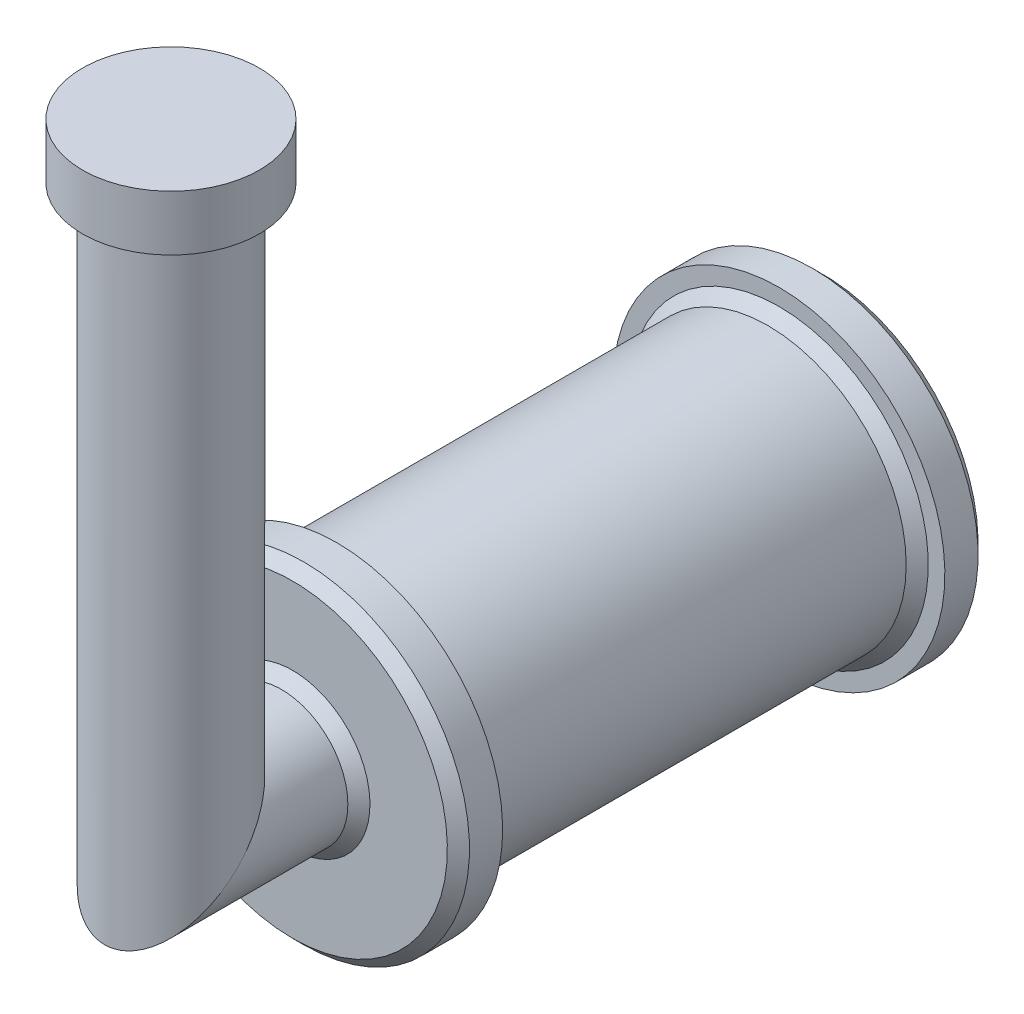
ISO-10303-21;
HEADER;
FILE_DESCRIPTION(('STEP AP214'),'2;1');
FILE_NAME('part.step','',(''),(''),'','','');
FILE_SCHEMA(('AUTOMOTIVE_DESIGN { 1 0 10303 214 1 1 1 1 }'));
ENDSEC;
DATA;
#1=APPLICATION_CONTEXT('core data for automotive mechanical design processes');
#2=APPLICATION_PROTOCOL_DEFINITION('international standard','automotive_design',2000,#1);
#3=PRODUCT_CONTEXT('',#1,'mechanical');
#4=PRODUCT('Part','Part','',(#3));
#5=PRODUCT_RELATED_PRODUCT_CATEGORY('part','',(#4));
#6=PRODUCT_DEFINITION_FORMATION('','',#4);
#7=PRODUCT_DEFINITION_CONTEXT('part definition',#1,'design');
#8=PRODUCT_DEFINITION('design','',#6,#7);
#9=PRODUCT_DEFINITION_SHAPE('','',#8);
#10=(LENGTH_UNIT() NAMED_UNIT(*) SI_UNIT(.MILLI.,.METRE.));
#11=(NAMED_UNIT(*) PLANE_ANGLE_UNIT() SI_UNIT($,.RADIAN.));
#12=(NAMED_UNIT(*) SI_UNIT($,.STERADIAN.) SOLID_ANGLE_UNIT());
#13=UNCERTAINTY_MEASURE_WITH_UNIT(LENGTH_MEASURE(1.E-05),#10,'distance_accuracy_value','');
#14=(GEOMETRIC_REPRESENTATION_CONTEXT(3) GLOBAL_UNCERTAINTY_ASSIGNED_CONTEXT((#13)) GLOBAL_UNIT_ASSIGNED_CONTEXT((#10,
#11,#12)) REPRESENTATION_CONTEXT('',''));
#15=CARTESIAN_POINT('',(0.,0.,0.));
#16=DIRECTION('',(0.,0.,1.));
#17=DIRECTION('',(1.,0.,0.));
#18=AXIS2_PLACEMENT_3D('',#15,#16,#17);
#19=CARTESIAN_POINT('',(0.,695.970875,0.));
#20=DIRECTION('',(0.,-1.,0.));
#21=DIRECTION('',(0.,0.,-1.));
#22=AXIS2_PLACEMENT_3D('',#19,#20,#21);
#23=CYLINDRICAL_SURFACE('',#22,75.);
#24=CARTESIAN_POINT('',(0.,0.,0.));
#25=DIRECTION('',(0.,-0.707106781186548,-0.707106781186548));
#26=DIRECTION('',(0.,-0.707106781186548,0.707106781186548));
#27=AXIS2_PLACEMENT_3D('',#24,#25,#26);
#28=ELLIPSE('',#27,106.066017177982,75.);
#29=CARTESIAN_POINT('',(0.,-75.,75.));
#30=VERTEX_POINT('',#29);
#31=EDGE_CURVE('E76',#30,#30,#28,.T.);
#32=ORIENTED_EDGE('',*,*,#31,.F.);
#33=EDGE_LOOP('',(#32));
#34=FACE_BOUND('',#33,.T.);
#35=CARTESIAN_POINT('',(0.,633.470875,0.));
#36=DIRECTION('',(0.,1.,0.));
#37=DIRECTION('',(0.,0.,1.));
#38=AXIS2_PLACEMENT_3D('',#35,#36,#37);
#39=CIRCLE('',#38,75.);
#40=CARTESIAN_POINT('',(0.,633.470875,75.));
#41=VERTEX_POINT('',#40);
#42=EDGE_CURVE('E73',#41,#41,#39,.T.);
#43=ORIENTED_EDGE('',*,*,#42,.F.);
#44=EDGE_LOOP('',(#43));
#45=FACE_BOUND('',#44,.T.);
#46=ADVANCED_FACE('F34',(#34,#45),#23,.T.);
#47=CARTESIAN_POINT('',(0.,0.,82.6));
#48=DIRECTION('',(0.,0.,-1.));
#49=DIRECTION('',(-1.,0.,0.));
#50=AXIS2_PLACEMENT_3D('',#47,#48,#49);
#51=CYLINDRICAL_SURFACE('',#50,75.);
#52=CARTESIAN_POINT('',(0.,0.,-125.));
#53=DIRECTION('',(0.,0.,1.));
#54=DIRECTION('',(1.,0.,0.));
#55=AXIS2_PLACEMENT_3D('',#52,#53,#54);
#56=CIRCLE('',#55,75.);
#57=CARTESIAN_POINT('',(75.,0.,-125.));
#58=VERTEX_POINT('',#57);
#59=EDGE_CURVE('E64',#58,#58,#56,.T.);
#60=ORIENTED_EDGE('',*,*,#59,.T.);
#61=EDGE_LOOP('',(#60));
#62=FACE_BOUND('',#61,.T.);
#63=ORIENTED_EDGE('',*,*,#31,.T.);
#64=EDGE_LOOP('',(#63));
#65=FACE_BOUND('',#64,.T.);
#66=ADVANCED_FACE('F109',(#62,#65),#51,.T.);
#67=CARTESIAN_POINT('',(0.,633.470875,0.));
#68=DIRECTION('',(0.,1.,0.));
#69=DIRECTION('',(0.,0.,1.));
#70=AXIS2_PLACEMENT_3D('',#67,#68,#69);
#71=CYLINDRICAL_SURFACE('',#70,100.);
#72=CARTESIAN_POINT('',(0.,633.470875,0.));
#73=DIRECTION('',(0.,1.,0.));
#74=DIRECTION('',(0.,0.,1.));
#75=AXIS2_PLACEMENT_3D('',#72,#73,#74);
#76=CIRCLE('',#75,100.);
#77=CARTESIAN_POINT('',(0.,633.470875,100.));
#78=VERTEX_POINT('',#77);
#79=EDGE_CURVE('E79',#78,#78,#76,.T.);
#80=ORIENTED_EDGE('',*,*,#79,.T.);
#81=EDGE_LOOP('',(#80));
#82=FACE_BOUND('',#81,.T.);
#83=CARTESIAN_POINT('',(0.,695.970875,0.));
#84=DIRECTION('',(0.,1.,0.));
#85=DIRECTION('',(0.,0.,1.));
#86=AXIS2_PLACEMENT_3D('',#83,#84,#85);
#87=CIRCLE('',#86,100.);
#88=CARTESIAN_POINT('',(0.,695.970875,100.));
#89=VERTEX_POINT('',#88);
#90=EDGE_CURVE('E80',#89,#89,#87,.T.);
#91=ORIENTED_EDGE('',*,*,#90,.F.);
#92=EDGE_LOOP('',(#91));
#93=FACE_BOUND('',#92,.T.);
#94=ADVANCED_FACE('F115',(#82,#93),#71,.T.);
#95=CARTESIAN_POINT('',(0.,633.470875,0.));
#96=DIRECTION('',(0.,1.,0.));
#97=DIRECTION('',(0.,0.,1.));
#98=AXIS2_PLACEMENT_3D('',#95,#96,#97);
#99=PLANE('',#98);
#100=ORIENTED_EDGE('',*,*,#42,.T.);
#101=EDGE_LOOP('',(#100));
#102=FACE_BOUND('',#101,.T.);
#103=ORIENTED_EDGE('',*,*,#79,.F.);
#104=EDGE_LOOP('',(#103));
#105=FACE_BOUND('',#104,.T.);
#106=ADVANCED_FACE('F127',(#102,#105),#99,.F.);
#107=CARTESIAN_POINT('',(0.,695.970875,0.));
#108=DIRECTION('',(0.,1.,0.));
#109=DIRECTION('',(0.,0.,1.));
#110=AXIS2_PLACEMENT_3D('',#107,#108,#109);
#111=PLANE('',#110);
#112=ORIENTED_EDGE('',*,*,#90,.T.);
#113=EDGE_LOOP('',(#112));
#114=FACE_BOUND('',#113,.T.);
#115=ADVANCED_FACE('F123',(#114),#111,.T.);
#116=CARTESIAN_POINT('',(0.,75.,-137.5));
#117=DIRECTION('',(0.,0.,1.));
#118=DIRECTION('',(0.,-1.,0.));
#119=AXIS2_PLACEMENT_3D('',#116,#117,#118);
#120=PLANE('',#119);
#121=CARTESIAN_POINT('',(0.,0.,-137.5));
#122=DIRECTION('',(0.,0.,1.));
#123=DIRECTION('',(0.,-1.,0.));
#124=AXIS2_PLACEMENT_3D('',#121,#122,#123);
#125=CIRCLE('',#124,87.4999999999998);
#126=CARTESIAN_POINT('',(0.,-87.4999999999998,-137.5));
#127=VERTEX_POINT('',#126);
#128=EDGE_CURVE('E67',#127,#127,#125,.F.);
#129=ORIENTED_EDGE('',*,*,#128,.T.);
#130=EDGE_LOOP('',(#129));
#131=FACE_BOUND('',#130,.T.);
#132=CARTESIAN_POINT('',(0.,0.,-137.5));
#133=DIRECTION('',(0.,0.,1.));
#134=DIRECTION('',(0.,-1.,0.));
#135=AXIS2_PLACEMENT_3D('',#132,#133,#134);
#136=CIRCLE('',#135,175.);
#137=CARTESIAN_POINT('',(0.,-175.,-137.5));
#138=VERTEX_POINT('',#137);
#139=EDGE_CURVE('E70',#138,#138,#136,.T.);
#140=ORIENTED_EDGE('',*,*,#139,.T.);
#141=EDGE_LOOP('',(#140));
#142=FACE_BOUND('',#141,.T.);
#143=ADVANCED_FACE('F126',(#131,#142),#120,.T.);
#144=CARTESIAN_POINT('',(0.,0.,-737.5));
#145=DIRECTION('',(0.,0.,-1.));
#146=DIRECTION('',(0.,1.,0.));
#147=AXIS2_PLACEMENT_3D('',#144,#145,#146);
#148=CYLINDRICAL_SURFACE('',#147,187.5);
#149=CARTESIAN_POINT('',(0.,0.,-150.));
#150=DIRECTION('',(0.,0.,1.));
#151=DIRECTION('',(0.,-1.,0.));
#152=AXIS2_PLACEMENT_3D('',#149,#150,#151);
#153=CIRCLE('',#152,187.5);
#154=CARTESIAN_POINT('',(0.,-187.5,-150.));
#155=VERTEX_POINT('',#154);
#156=EDGE_CURVE('E61',#155,#155,#153,.F.);
#157=ORIENTED_EDGE('',*,*,#156,.T.);
#158=EDGE_LOOP('',(#157));
#159=FACE_BOUND('',#158,.T.);
#160=CARTESIAN_POINT('',(0.,0.,-187.5));
#161=DIRECTION('',(0.,0.,-1.));
#162=DIRECTION('',(0.,1.,0.));
#163=AXIS2_PLACEMENT_3D('',#160,#161,#162);
#164=CIRCLE('',#163,187.5);
#165=CARTESIAN_POINT('',(0.,187.5,-187.5));
#166=VERTEX_POINT('',#165);
#167=EDGE_CURVE('E83',#166,#166,#164,.T.);
#168=ORIENTED_EDGE('',*,*,#167,.F.);
#169=EDGE_LOOP('',(#168));
#170=FACE_BOUND('',#169,.T.);
#171=ADVANCED_FACE('F223',(#159,#170),#148,.T.);
#172=CARTESIAN_POINT('',(0.,156.25,-187.5));
#173=DIRECTION('',(0.,0.,-1.));
#174=DIRECTION('',(0.,1.,0.));
#175=AXIS2_PLACEMENT_3D('',#172,#173,#174);
#176=PLANE('',#175);
#177=CARTESIAN_POINT('',(0.,0.,-187.5));
#178=DIRECTION('',(0.,0.,-1.));
#179=DIRECTION('',(0.,1.,0.));
#180=AXIS2_PLACEMENT_3D('',#177,#178,#179);
#181=CIRCLE('',#180,168.75);
#182=CARTESIAN_POINT('',(0.,168.75,-187.5));
#183=VERTEX_POINT('',#182);
#184=EDGE_CURVE('E10',#183,#183,#181,.F.);
#185=ORIENTED_EDGE('',*,*,#184,.T.);
#186=EDGE_LOOP('',(#185));
#187=FACE_BOUND('',#186,.T.);
#188=ORIENTED_EDGE('',*,*,#167,.T.);
#189=EDGE_LOOP('',(#188));
#190=FACE_BOUND('',#189,.T.);
#191=ADVANCED_FACE('F106',(#187,#190),#176,.T.);
#192=CARTESIAN_POINT('',(0.,0.,-737.5));
#193=DIRECTION('',(0.,0.,-1.));
#194=DIRECTION('',(0.,1.,0.));
#195=AXIS2_PLACEMENT_3D('',#192,#193,#194);
#196=CYLINDRICAL_SURFACE('',#195,156.25);
#197=CARTESIAN_POINT('',(0.,0.,-675.));
#198=DIRECTION('',(0.,0.,1.));
#199=DIRECTION('',(0.,-1.,0.));
#200=AXIS2_PLACEMENT_3D('',#197,#198,#199);
#201=CIRCLE('',#200,156.25);
#202=CARTESIAN_POINT('',(0.,-156.25,-675.));
#203=VERTEX_POINT('',#202);
#204=EDGE_CURVE('E42',#203,#203,#201,.T.);
#205=ORIENTED_EDGE('',*,*,#204,.T.);
#206=EDGE_LOOP('',(#205));
#207=FACE_BOUND('',#206,.T.);
#208=CARTESIAN_POINT('',(0.,0.,-200.));
#209=DIRECTION('',(0.,0.,-1.));
#210=DIRECTION('',(0.,1.,0.));
#211=AXIS2_PLACEMENT_3D('',#208,#209,#210);
#212=CIRCLE('',#211,156.25);
#213=CARTESIAN_POINT('',(0.,156.25,-200.));
#214=VERTEX_POINT('',#213);
#215=EDGE_CURVE('E46',#214,#214,#212,.T.);
#216=ORIENTED_EDGE('',*,*,#215,.T.);
#217=EDGE_LOOP('',(#216));
#218=FACE_BOUND('',#217,.T.);
#219=ADVANCED_FACE('F96',(#207,#218),#196,.T.);
#220=CARTESIAN_POINT('',(0.,156.25,-687.5));
#221=DIRECTION('',(0.,0.,1.));
#222=DIRECTION('',(0.,-1.,0.));
#223=AXIS2_PLACEMENT_3D('',#220,#221,#222);
#224=PLANE('',#223);
#225=CARTESIAN_POINT('',(0.,0.,-687.5));
#226=DIRECTION('',(0.,0.,1.));
#227=DIRECTION('',(0.,-1.,0.));
#228=AXIS2_PLACEMENT_3D('',#225,#226,#227);
#229=CIRCLE('',#228,168.75);
#230=CARTESIAN_POINT('',(0.,-168.75,-687.5));
#231=VERTEX_POINT('',#230);
#232=EDGE_CURVE('E50',#231,#231,#229,.F.);
#233=ORIENTED_EDGE('',*,*,#232,.T.);
#234=EDGE_LOOP('',(#233));
#235=FACE_BOUND('',#234,.T.);
#236=CARTESIAN_POINT('',(0.,0.,-687.5));
#237=DIRECTION('',(0.,0.,-1.));
#238=DIRECTION('',(0.,1.,0.));
#239=AXIS2_PLACEMENT_3D('',#236,#237,#238);
#240=CIRCLE('',#239,187.5);
#241=CARTESIAN_POINT('',(0.,187.5,-687.5));
#242=VERTEX_POINT('',#241);
#243=EDGE_CURVE('E88',#242,#242,#240,.T.);
#244=ORIENTED_EDGE('',*,*,#243,.F.);
#245=EDGE_LOOP('',(#244));
#246=FACE_BOUND('',#245,.T.);
#247=ADVANCED_FACE('F94',(#235,#246),#224,.T.);
#248=CARTESIAN_POINT('',(0.,0.,-737.5));
#249=DIRECTION('',(0.,0.,-1.));
#250=DIRECTION('',(0.,1.,0.));
#251=AXIS2_PLACEMENT_3D('',#248,#249,#250);
#252=CYLINDRICAL_SURFACE('',#251,187.5);
#253=CARTESIAN_POINT('',(0.,0.,-725.000000000001));
#254=DIRECTION('',(0.,0.,1.));
#255=DIRECTION('',(0.,-1.,0.));
#256=AXIS2_PLACEMENT_3D('',#253,#254,#255);
#257=CIRCLE('',#256,187.5);
#258=CARTESIAN_POINT('',(0.,-187.5,-725.000000000001));
#259=VERTEX_POINT('',#258);
#260=EDGE_CURVE('E55',#259,#259,#257,.T.);
#261=ORIENTED_EDGE('',*,*,#260,.T.);
#262=EDGE_LOOP('',(#261));
#263=FACE_BOUND('',#262,.T.);
#264=ORIENTED_EDGE('',*,*,#243,.T.);
#265=EDGE_LOOP('',(#264));
#266=FACE_BOUND('',#265,.T.);
#267=ADVANCED_FACE('F92',(#263,#266),#252,.T.);
#268=CARTESIAN_POINT('',(0.,0.,-737.5));
#269=DIRECTION('',(0.,0.,1.));
#270=DIRECTION('',(0.,-1.,0.));
#271=AXIS2_PLACEMENT_3D('',#268,#269,#270);
#272=PLANE('',#271);
#273=CARTESIAN_POINT('',(0.,0.,-737.5));
#274=DIRECTION('',(0.,0.,1.));
#275=DIRECTION('',(0.,-1.,0.));
#276=AXIS2_PLACEMENT_3D('',#273,#274,#275);
#277=CIRCLE('',#276,175.);
#278=CARTESIAN_POINT('',(0.,-175.,-737.5));
#279=VERTEX_POINT('',#278);
#280=EDGE_CURVE('E58',#279,#279,#277,.F.);
#281=ORIENTED_EDGE('',*,*,#280,.T.);
#282=EDGE_LOOP('',(#281));
#283=FACE_BOUND('',#282,.T.);
#284=ADVANCED_FACE('F103',(#283),#272,.F.);
#285=CARTESIAN_POINT('',(0.,0.,-137.5));
#286=DIRECTION('',(0.,0.,-1.));
#287=DIRECTION('',(-1.,0.,0.));
#288=AXIS2_PLACEMENT_3D('',#285,#286,#287);
#289=CONICAL_SURFACE('',#288,87.4999999999998,0.785398163397453);
#290=ORIENTED_EDGE('',*,*,#59,.F.);
#291=EDGE_LOOP('',(#290));
#292=FACE_BOUND('',#291,.T.);
#293=ORIENTED_EDGE('',*,*,#128,.F.);
#294=EDGE_LOOP('',(#293));
#295=FACE_BOUND('',#294,.T.);
#296=ADVANCED_FACE('F131',(#292,#295),#289,.T.);
#297=CARTESIAN_POINT('',(0.,0.,-150.));
#298=DIRECTION('',(0.,0.,-1.));
#299=DIRECTION('',(0.,1.,0.));
#300=AXIS2_PLACEMENT_3D('',#297,#298,#299);
#301=CONICAL_SURFACE('',#300,187.5,0.785398163397449);
#302=ORIENTED_EDGE('',*,*,#139,.F.);
#303=EDGE_LOOP('',(#302));
#304=FACE_BOUND('',#303,.T.);
#305=ORIENTED_EDGE('',*,*,#156,.F.);
#306=EDGE_LOOP('',(#305));
#307=FACE_BOUND('',#306,.T.);
#308=ADVANCED_FACE('F139',(#304,#307),#301,.T.);
#309=CARTESIAN_POINT('',(0.,0.,-737.5));
#310=DIRECTION('',(0.,0.,1.));
#311=DIRECTION('',(0.,-1.,0.));
#312=AXIS2_PLACEMENT_3D('',#309,#310,#311);
#313=CONICAL_SURFACE('',#312,175.,0.785398163397452);
#314=ORIENTED_EDGE('',*,*,#260,.F.);
#315=EDGE_LOOP('',(#314));
#316=FACE_BOUND('',#315,.T.);
#317=ORIENTED_EDGE('',*,*,#280,.F.);
#318=EDGE_LOOP('',(#317));
#319=FACE_BOUND('',#318,.T.);
#320=ADVANCED_FACE('F146',(#316,#319),#313,.T.);
#321=CARTESIAN_POINT('',(0.,0.,-687.5));
#322=DIRECTION('',(0.,0.,-1.));
#323=DIRECTION('',(0.,1.,0.));
#324=AXIS2_PLACEMENT_3D('',#321,#322,#323);
#325=CONICAL_SURFACE('',#324,168.75,0.785398163397457);
#326=ORIENTED_EDGE('',*,*,#204,.F.);
#327=EDGE_LOOP('',(#326));
#328=FACE_BOUND('',#327,.T.);
#329=ORIENTED_EDGE('',*,*,#232,.F.);
#330=EDGE_LOOP('',(#329));
#331=FACE_BOUND('',#330,.T.);
#332=ADVANCED_FACE('F152',(#328,#331),#325,.T.);
#333=CARTESIAN_POINT('',(0.,0.,-200.));
#334=DIRECTION('',(0.,0.,1.));
#335=DIRECTION('',(0.,-1.,0.));
#336=AXIS2_PLACEMENT_3D('',#333,#334,#335);
#337=CONICAL_SURFACE('',#336,156.25,0.785398163397439);
#338=ORIENTED_EDGE('',*,*,#184,.F.);
#339=EDGE_LOOP('',(#338));
#340=FACE_BOUND('',#339,.T.);
#341=ORIENTED_EDGE('',*,*,#215,.F.);
#342=EDGE_LOOP('',(#341));
#343=FACE_BOUND('',#342,.T.);
#344=ADVANCED_FACE('F37',(#340,#343),#337,.T.);
#345=CLOSED_SHELL('',(#46,#66,#94,#106,#115,#143,#171,#191,#219,#247,#267,#284,#296,#308,#320,
#332,#344));
#346=MANIFOLD_SOLID_BREP('B2',#345);
#347=ADVANCED_BREP_SHAPE_REPRESENTATION('',(#18,#346),#14);
#348=SHAPE_DEFINITION_REPRESENTATION(#9,#347);
ENDSEC;
END-ISO-10303-21;
